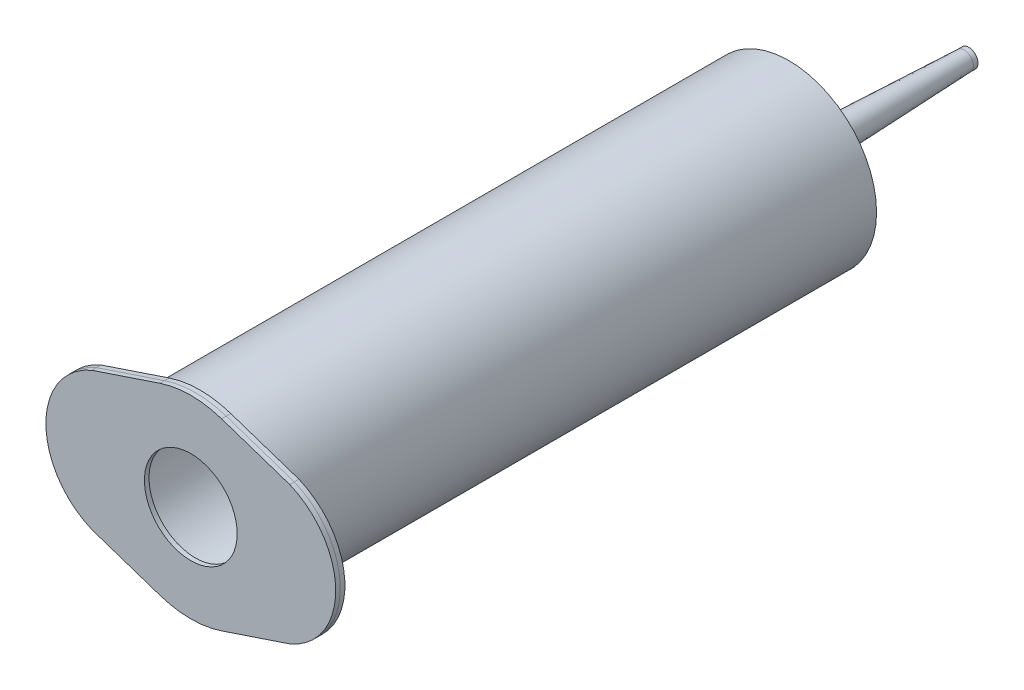
ISO-10303-21;
HEADER;
FILE_DESCRIPTION(('STEP AP214'),'2;1');
FILE_NAME('part.step','',(''),(''),'','','');
FILE_SCHEMA(('AUTOMOTIVE_DESIGN { 1 0 10303 214 1 1 1 1 }'));
ENDSEC;
DATA;
#1=APPLICATION_CONTEXT('core data for automotive mechanical design processes');
#2=APPLICATION_PROTOCOL_DEFINITION('international standard','automotive_design',2000,#1);
#3=PRODUCT_CONTEXT('',#1,'mechanical');
#4=PRODUCT('Part','Part','',(#3));
#5=PRODUCT_RELATED_PRODUCT_CATEGORY('part','',(#4));
#6=PRODUCT_DEFINITION_FORMATION('','',#4);
#7=PRODUCT_DEFINITION_CONTEXT('part definition',#1,'design');
#8=PRODUCT_DEFINITION('design','',#6,#7);
#9=PRODUCT_DEFINITION_SHAPE('','',#8);
#10=(LENGTH_UNIT() NAMED_UNIT(*) SI_UNIT(.MILLI.,.METRE.));
#11=(NAMED_UNIT(*) PLANE_ANGLE_UNIT() SI_UNIT($,.RADIAN.));
#12=(NAMED_UNIT(*) SI_UNIT($,.STERADIAN.) SOLID_ANGLE_UNIT());
#13=UNCERTAINTY_MEASURE_WITH_UNIT(LENGTH_MEASURE(1.E-05),#10,'distance_accuracy_value','');
#14=(GEOMETRIC_REPRESENTATION_CONTEXT(3) GLOBAL_UNCERTAINTY_ASSIGNED_CONTEXT((#13)) GLOBAL_UNIT_ASSIGNED_CONTEXT((#10,
#11,#12)) REPRESENTATION_CONTEXT('',''));
#15=CARTESIAN_POINT('',(0.,0.,0.));
#16=DIRECTION('',(0.,0.,1.));
#17=DIRECTION('',(1.,0.,0.));
#18=AXIS2_PLACEMENT_3D('',#15,#16,#17);
#19=CARTESIAN_POINT('',(6.68321649398183,19.9608896919593,126.));
#20=DIRECTION('',(0.31749247002289,0.94826079296719,0.));
#21=DIRECTION('',(-0.94826079296719,0.31749247002289,0.));
#22=AXIS2_PLACEMENT_3D('',#19,#20,#21);
#23=PLANE('',#22);
#24=DIRECTION('',(-0.94826079296719,0.31749247002289,0.));
#25=VECTOR('',#24,1.);
#26=CARTESIAN_POINT('',(6.68321649398183,19.9608896919593,127.));
#27=LINE('',#26,#25);
#28=CARTESIAN_POINT('',(21.4999999999999,15.,127.));
#29=VERTEX_POINT('',#28);
#30=CARTESIAN_POINT('',(6.68321649398172,19.9608896919593,127.));
#31=VERTEX_POINT('',#30);
#32=EDGE_CURVE('E174',#29,#31,#27,.T.);
#33=ORIENTED_EDGE('',*,*,#32,.F.);
#34=DIRECTION('',(0.,0.,1.));
#35=VECTOR('',#34,1.);
#36=CARTESIAN_POINT('',(21.4999999999999,15.,126.));
#37=LINE('',#36,#35);
#38=CARTESIAN_POINT('',(21.4999999999999,15.,126.));
#39=VERTEX_POINT('',#38);
#40=EDGE_CURVE('E13',#39,#29,#37,.T.);
#41=ORIENTED_EDGE('',*,*,#40,.F.);
#42=DIRECTION('',(-0.94826079296719,0.31749247002289,0.));
#43=VECTOR('',#42,1.);
#44=CARTESIAN_POINT('',(6.68321649398183,19.9608896919593,126.));
#45=LINE('',#44,#43);
#46=CARTESIAN_POINT('',(6.68321649398172,19.9608896919593,126.));
#47=VERTEX_POINT('',#46);
#48=EDGE_CURVE('E202',#39,#47,#45,.T.);
#49=ORIENTED_EDGE('',*,*,#48,.T.);
#50=DIRECTION('',(0.,0.,1.));
#51=VECTOR('',#50,1.);
#52=CARTESIAN_POINT('',(6.68321649398172,19.9608896919593,126.));
#53=LINE('',#52,#51);
#54=EDGE_CURVE('E75',#47,#31,#53,.T.);
#55=ORIENTED_EDGE('',*,*,#54,.T.);
#56=EDGE_LOOP('',(#33,#41,#49,#55));
#57=FACE_BOUND('',#56,.T.);
#58=ADVANCED_FACE('F71',(#57),#23,.T.);
#59=CARTESIAN_POINT('',(15.25,0.,126.));
#60=DIRECTION('',(0.,0.,1.));
#61=DIRECTION('',(1.,0.,0.));
#62=AXIS2_PLACEMENT_3D('',#59,#60,#61);
#63=CYLINDRICAL_SURFACE('',#62,16.2499999999999);
#64=CARTESIAN_POINT('',(15.25,0.,127.));
#65=DIRECTION('',(0.,0.,1.));
#66=DIRECTION('',(1.,0.,0.));
#67=AXIS2_PLACEMENT_3D('',#64,#65,#66);
#68=CIRCLE('',#67,16.2499999999999);
#69=CARTESIAN_POINT('',(21.5000000000001,-14.9999999999998,127.));
#70=VERTEX_POINT('',#69);
#71=EDGE_CURVE('E192',#29,#70,#68,.F.);
#72=ORIENTED_EDGE('',*,*,#71,.T.);
#73=DIRECTION('',(0.,0.,1.));
#74=VECTOR('',#73,1.);
#75=CARTESIAN_POINT('',(21.5000000000001,-14.9999999999998,126.));
#76=LINE('',#75,#74);
#77=CARTESIAN_POINT('',(21.5000000000001,-14.9999999999998,126.));
#78=VERTEX_POINT('',#77);
#79=EDGE_CURVE('E81',#78,#70,#76,.T.);
#80=ORIENTED_EDGE('',*,*,#79,.F.);
#81=CARTESIAN_POINT('',(15.25,0.,126.));
#82=DIRECTION('',(0.,0.,1.));
#83=DIRECTION('',(1.,0.,0.));
#84=AXIS2_PLACEMENT_3D('',#81,#82,#83);
#85=CIRCLE('',#84,16.2499999999999);
#86=EDGE_CURVE('E153',#39,#78,#85,.F.);
#87=ORIENTED_EDGE('',*,*,#86,.F.);
#88=ORIENTED_EDGE('',*,*,#40,.T.);
#89=EDGE_LOOP('',(#72,#80,#87,#88));
#90=FACE_BOUND('',#89,.T.);
#91=ADVANCED_FACE('F206',(#90),#63,.T.);
#92=CARTESIAN_POINT('',(6.68321649398213,-19.9608896919593,126.));
#93=DIRECTION('',(-0.317492470022903,0.948260792967186,0.));
#94=DIRECTION('',(-0.948260792967186,-0.317492470022903,0.));
#95=AXIS2_PLACEMENT_3D('',#92,#93,#94);
#96=PLANE('',#95);
#97=DIRECTION('',(-0.948260792967186,-0.317492470022903,0.));
#98=VECTOR('',#97,1.);
#99=CARTESIAN_POINT('',(6.68321649398213,-19.9608896919593,127.));
#100=LINE('',#99,#98);
#101=CARTESIAN_POINT('',(6.68321649398198,-19.9608896919593,127.));
#102=VERTEX_POINT('',#101);
#103=EDGE_CURVE('E118',#70,#102,#100,.T.);
#104=ORIENTED_EDGE('',*,*,#103,.T.);
#105=DIRECTION('',(0.,0.,1.));
#106=VECTOR('',#105,1.);
#107=CARTESIAN_POINT('',(6.68321649398198,-19.9608896919593,126.));
#108=LINE('',#107,#106);
#109=CARTESIAN_POINT('',(6.68321649398198,-19.9608896919593,126.));
#110=VERTEX_POINT('',#109);
#111=EDGE_CURVE('E157',#110,#102,#108,.T.);
#112=ORIENTED_EDGE('',*,*,#111,.F.);
#113=DIRECTION('',(-0.948260792967186,-0.317492470022903,0.));
#114=VECTOR('',#113,1.);
#115=CARTESIAN_POINT('',(6.68321649398213,-19.9608896919593,126.));
#116=LINE('',#115,#114);
#117=EDGE_CURVE('E145',#78,#110,#116,.T.);
#118=ORIENTED_EDGE('',*,*,#117,.F.);
#119=ORIENTED_EDGE('',*,*,#79,.T.);
#120=EDGE_LOOP('',(#104,#112,#118,#119));
#121=FACE_BOUND('',#120,.T.);
#122=ADVANCED_FACE('F158',(#121),#96,.F.);
#123=CARTESIAN_POINT('',(0.,0.,126.));
#124=DIRECTION('',(0.,0.,1.));
#125=DIRECTION('',(1.,0.,0.));
#126=AXIS2_PLACEMENT_3D('',#123,#124,#125);
#127=CYLINDRICAL_SURFACE('',#126,21.05);
#128=CARTESIAN_POINT('',(0.,0.,127.));
#129=DIRECTION('',(0.,0.,1.));
#130=DIRECTION('',(1.,0.,0.));
#131=AXIS2_PLACEMENT_3D('',#128,#129,#130);
#132=CIRCLE('',#131,21.05);
#133=CARTESIAN_POINT('',(-6.68321649398184,-19.9608896919593,127.));
#134=VERTEX_POINT('',#133);
#135=EDGE_CURVE('E189',#134,#102,#132,.T.);
#136=ORIENTED_EDGE('',*,*,#135,.F.);
#137=DIRECTION('',(0.,0.,1.));
#138=VECTOR('',#137,1.);
#139=CARTESIAN_POINT('',(-6.68321649398184,-19.9608896919593,126.));
#140=LINE('',#139,#138);
#141=CARTESIAN_POINT('',(-6.68321649398184,-19.9608896919593,126.));
#142=VERTEX_POINT('',#141);
#143=EDGE_CURVE('E161',#142,#134,#140,.T.);
#144=ORIENTED_EDGE('',*,*,#143,.F.);
#145=CARTESIAN_POINT('',(0.,0.,126.));
#146=DIRECTION('',(0.,0.,1.));
#147=DIRECTION('',(1.,0.,0.));
#148=AXIS2_PLACEMENT_3D('',#145,#146,#147);
#149=CIRCLE('',#148,21.05);
#150=EDGE_CURVE('E151',#142,#110,#149,.T.);
#151=ORIENTED_EDGE('',*,*,#150,.T.);
#152=ORIENTED_EDGE('',*,*,#111,.T.);
#153=EDGE_LOOP('',(#136,#144,#151,#152));
#154=FACE_BOUND('',#153,.T.);
#155=ADVANCED_FACE('F163',(#154),#127,.T.);
#156=CARTESIAN_POINT('',(-6.68321649398183,-19.9608896919593,126.));
#157=DIRECTION('',(-0.31749247002289,-0.94826079296719,0.));
#158=DIRECTION('',(0.94826079296719,-0.31749247002289,0.));
#159=AXIS2_PLACEMENT_3D('',#156,#157,#158);
#160=PLANE('',#159);
#161=DIRECTION('',(0.94826079296719,-0.31749247002289,0.));
#162=VECTOR('',#161,1.);
#163=CARTESIAN_POINT('',(-6.68321649398183,-19.9608896919593,127.));
#164=LINE('',#163,#162);
#165=CARTESIAN_POINT('',(-21.5,-15.,127.));
#166=VERTEX_POINT('',#165);
#167=EDGE_CURVE('E186',#166,#134,#164,.T.);
#168=ORIENTED_EDGE('',*,*,#167,.F.);
#169=DIRECTION('',(0.,0.,1.));
#170=VECTOR('',#169,1.);
#171=CARTESIAN_POINT('',(-21.5,-15.,126.));
#172=LINE('',#171,#170);
#173=CARTESIAN_POINT('',(-21.5,-15.,126.));
#174=VERTEX_POINT('',#173);
#175=EDGE_CURVE('E197',#174,#166,#172,.T.);
#176=ORIENTED_EDGE('',*,*,#175,.F.);
#177=DIRECTION('',(0.94826079296719,-0.31749247002289,0.));
#178=VECTOR('',#177,1.);
#179=CARTESIAN_POINT('',(-6.68321649398183,-19.9608896919593,126.));
#180=LINE('',#179,#178);
#181=EDGE_CURVE('E164',#174,#142,#180,.T.);
#182=ORIENTED_EDGE('',*,*,#181,.T.);
#183=ORIENTED_EDGE('',*,*,#143,.T.);
#184=EDGE_LOOP('',(#168,#176,#182,#183));
#185=FACE_BOUND('',#184,.T.);
#186=ADVANCED_FACE('F222',(#185),#160,.T.);
#187=CARTESIAN_POINT('',(-15.25,0.,126.));
#188=DIRECTION('',(0.,0.,1.));
#189=DIRECTION('',(1.,0.,0.));
#190=AXIS2_PLACEMENT_3D('',#187,#188,#189);
#191=CYLINDRICAL_SURFACE('',#190,16.25);
#192=CARTESIAN_POINT('',(-15.25,0.,127.));
#193=DIRECTION('',(0.,0.,1.));
#194=DIRECTION('',(1.,0.,0.));
#195=AXIS2_PLACEMENT_3D('',#192,#193,#194);
#196=CIRCLE('',#195,16.25);
#197=CARTESIAN_POINT('',(-21.5,15.,127.));
#198=VERTEX_POINT('',#197);
#199=EDGE_CURVE('E183',#198,#166,#196,.T.);
#200=ORIENTED_EDGE('',*,*,#199,.F.);
#201=DIRECTION('',(0.,0.,1.));
#202=VECTOR('',#201,1.);
#203=CARTESIAN_POINT('',(-21.5,15.,126.));
#204=LINE('',#203,#202);
#205=CARTESIAN_POINT('',(-21.5,15.,126.));
#206=VERTEX_POINT('',#205);
#207=EDGE_CURVE('E199',#206,#198,#204,.T.);
#208=ORIENTED_EDGE('',*,*,#207,.F.);
#209=CARTESIAN_POINT('',(-15.25,0.,126.));
#210=DIRECTION('',(0.,0.,1.));
#211=DIRECTION('',(1.,0.,0.));
#212=AXIS2_PLACEMENT_3D('',#209,#210,#211);
#213=CIRCLE('',#212,16.25);
#214=EDGE_CURVE('E166',#206,#174,#213,.T.);
#215=ORIENTED_EDGE('',*,*,#214,.T.);
#216=ORIENTED_EDGE('',*,*,#175,.T.);
#217=EDGE_LOOP('',(#200,#208,#215,#216));
#218=FACE_BOUND('',#217,.T.);
#219=ADVANCED_FACE('F218',(#218),#191,.T.);
#220=CARTESIAN_POINT('',(-6.68321649398185,19.9608896919593,126.));
#221=DIRECTION('',(0.317492470022891,-0.94826079296719,0.));
#222=DIRECTION('',(0.94826079296719,0.317492470022891,0.));
#223=AXIS2_PLACEMENT_3D('',#220,#221,#222);
#224=PLANE('',#223);
#225=DIRECTION('',(0.94826079296719,0.317492470022891,0.));
#226=VECTOR('',#225,1.);
#227=CARTESIAN_POINT('',(-6.68321649398185,19.9608896919593,127.));
#228=LINE('',#227,#226);
#229=CARTESIAN_POINT('',(-6.68321649398185,19.9608896919593,127.));
#230=VERTEX_POINT('',#229);
#231=EDGE_CURVE('E180',#198,#230,#228,.T.);
#232=ORIENTED_EDGE('',*,*,#231,.T.);
#233=DIRECTION('',(0.,0.,1.));
#234=VECTOR('',#233,1.);
#235=CARTESIAN_POINT('',(-6.68321649398185,19.9608896919593,126.));
#236=LINE('',#235,#234);
#237=CARTESIAN_POINT('',(-6.68321649398185,19.9608896919593,126.));
#238=VERTEX_POINT('',#237);
#239=EDGE_CURVE('E200',#238,#230,#236,.T.);
#240=ORIENTED_EDGE('',*,*,#239,.F.);
#241=DIRECTION('',(0.94826079296719,0.317492470022891,0.));
#242=VECTOR('',#241,1.);
#243=CARTESIAN_POINT('',(-6.68321649398185,19.9608896919593,126.));
#244=LINE('',#243,#242);
#245=EDGE_CURVE('E209',#206,#238,#244,.T.);
#246=ORIENTED_EDGE('',*,*,#245,.F.);
#247=ORIENTED_EDGE('',*,*,#207,.T.);
#248=EDGE_LOOP('',(#232,#240,#246,#247));
#249=FACE_BOUND('',#248,.T.);
#250=ADVANCED_FACE('F224',(#249),#224,.F.);
#251=CARTESIAN_POINT('',(0.,0.,126.));
#252=DIRECTION('',(0.,0.,1.));
#253=DIRECTION('',(1.,0.,0.));
#254=AXIS2_PLACEMENT_3D('',#251,#252,#253);
#255=CYLINDRICAL_SURFACE('',#254,19.05);
#256=CARTESIAN_POINT('',(0.,0.,126.));
#257=DIRECTION('',(0.,0.,1.));
#258=DIRECTION('',(1.,0.,0.));
#259=AXIS2_PLACEMENT_3D('',#256,#257,#258);
#260=CIRCLE('',#259,19.05);
#261=CARTESIAN_POINT('',(19.05,0.,126.));
#262=VERTEX_POINT('',#261);
#263=EDGE_CURVE('E193',#262,#262,#260,.T.);
#264=ORIENTED_EDGE('',*,*,#263,.F.);
#265=EDGE_LOOP('',(#264));
#266=FACE_BOUND('',#265,.T.);
#267=CARTESIAN_POINT('',(0.,0.,127.));
#268=DIRECTION('',(0.,0.,1.));
#269=DIRECTION('',(1.,0.,0.));
#270=AXIS2_PLACEMENT_3D('',#267,#268,#269);
#271=CIRCLE('',#270,19.05);
#272=CARTESIAN_POINT('',(19.05,0.,127.));
#273=VERTEX_POINT('',#272);
#274=EDGE_CURVE('E171',#273,#273,#271,.T.);
#275=ORIENTED_EDGE('',*,*,#274,.T.);
#276=EDGE_LOOP('',(#275));
#277=FACE_BOUND('',#276,.T.);
#278=ADVANCED_FACE('F73',(#266,#277),#255,.F.);
#279=CARTESIAN_POINT('',(0.,0.,126.));
#280=DIRECTION('',(0.,0.,1.));
#281=DIRECTION('',(1.,0.,0.));
#282=AXIS2_PLACEMENT_3D('',#279,#280,#281);
#283=CYLINDRICAL_SURFACE('',#282,21.05);
#284=CARTESIAN_POINT('',(0.,0.,127.));
#285=DIRECTION('',(0.,0.,1.));
#286=DIRECTION('',(1.,0.,0.));
#287=AXIS2_PLACEMENT_3D('',#284,#285,#286);
#288=CIRCLE('',#287,21.05);
#289=EDGE_CURVE('E177',#31,#230,#288,.T.);
#290=ORIENTED_EDGE('',*,*,#289,.F.);
#291=ORIENTED_EDGE('',*,*,#54,.F.);
#292=CARTESIAN_POINT('',(0.,0.,126.));
#293=DIRECTION('',(0.,0.,1.));
#294=DIRECTION('',(1.,0.,0.));
#295=AXIS2_PLACEMENT_3D('',#292,#293,#294);
#296=CIRCLE('',#295,21.05);
#297=EDGE_CURVE('E207',#47,#238,#296,.T.);
#298=ORIENTED_EDGE('',*,*,#297,.T.);
#299=ORIENTED_EDGE('',*,*,#239,.T.);
#300=EDGE_LOOP('',(#290,#291,#298,#299));
#301=FACE_BOUND('',#300,.T.);
#302=ADVANCED_FACE('F203',(#301),#283,.T.);
#303=CARTESIAN_POINT('',(0.,0.,126.));
#304=DIRECTION('',(0.,0.,1.));
#305=DIRECTION('',(1.,0.,0.));
#306=AXIS2_PLACEMENT_3D('',#303,#304,#305);
#307=PLANE('',#306);
#308=ORIENTED_EDGE('',*,*,#263,.T.);
#309=EDGE_LOOP('',(#308));
#310=FACE_BOUND('',#309,.T.);
#311=ORIENTED_EDGE('',*,*,#48,.F.);
#312=ORIENTED_EDGE('',*,*,#86,.T.);
#313=ORIENTED_EDGE('',*,*,#117,.T.);
#314=ORIENTED_EDGE('',*,*,#150,.F.);
#315=ORIENTED_EDGE('',*,*,#181,.F.);
#316=ORIENTED_EDGE('',*,*,#214,.F.);
#317=ORIENTED_EDGE('',*,*,#245,.T.);
#318=ORIENTED_EDGE('',*,*,#297,.F.);
#319=EDGE_LOOP('',(#311,#312,#313,#314,#315,#316,#317,#318));
#320=FACE_BOUND('',#319,.T.);
#321=ADVANCED_FACE('F148',(#310,#320),#307,.F.);
#322=CARTESIAN_POINT('',(0.,0.,127.));
#323=DIRECTION('',(0.,0.,1.));
#324=DIRECTION('',(1.,0.,0.));
#325=AXIS2_PLACEMENT_3D('',#322,#323,#324);
#326=PLANE('',#325);
#327=ORIENTED_EDGE('',*,*,#274,.F.);
#328=EDGE_LOOP('',(#327));
#329=FACE_BOUND('',#328,.T.);
#330=ORIENTED_EDGE('',*,*,#32,.T.);
#331=ORIENTED_EDGE('',*,*,#289,.T.);
#332=ORIENTED_EDGE('',*,*,#231,.F.);
#333=ORIENTED_EDGE('',*,*,#199,.T.);
#334=ORIENTED_EDGE('',*,*,#167,.T.);
#335=ORIENTED_EDGE('',*,*,#135,.T.);
#336=ORIENTED_EDGE('',*,*,#103,.F.);
#337=ORIENTED_EDGE('',*,*,#71,.F.);
#338=EDGE_LOOP('',(#330,#331,#332,#333,#334,#335,#336,#337));
#339=FACE_BOUND('',#338,.T.);
#340=ADVANCED_FACE('F205',(#329,#339),#326,.T.);
#341=CLOSED_SHELL('',(#58,#91,#122,#155,#186,#219,#250,#278,#302,#321,#340));
#342=MANIFOLD_SOLID_BREP('B2',#341);
#343=CARTESIAN_POINT('',(0.,0.,127.));
#344=DIRECTION('',(0.,0.,-1.));
#345=DIRECTION('',(-1.,0.,0.));
#346=AXIS2_PLACEMENT_3D('',#343,#344,#345);
#347=CYLINDRICAL_SURFACE('',#346,19.05);
#348=CARTESIAN_POINT('',(0.,0.,127.));
#349=DIRECTION('',(0.,0.,1.));
#350=DIRECTION('',(1.,0.,0.));
#351=AXIS2_PLACEMENT_3D('',#348,#349,#350);
#352=CIRCLE('',#351,19.05);
#353=CARTESIAN_POINT('',(19.05,0.,127.));
#354=VERTEX_POINT('',#353);
#355=EDGE_CURVE('E328',#354,#354,#352,.T.);
#356=ORIENTED_EDGE('',*,*,#355,.F.);
#357=EDGE_LOOP('',(#356));
#358=FACE_BOUND('',#357,.T.);
#359=CARTESIAN_POINT('',(0.,0.,-2.));
#360=DIRECTION('',(0.,0.,1.));
#361=DIRECTION('',(1.,0.,0.));
#362=AXIS2_PLACEMENT_3D('',#359,#360,#361);
#363=CIRCLE('',#362,19.05);
#364=CARTESIAN_POINT('',(19.05,0.,-2.));
#365=VERTEX_POINT('',#364);
#366=EDGE_CURVE('E478',#365,#365,#363,.T.);
#367=ORIENTED_EDGE('',*,*,#366,.T.);
#368=EDGE_LOOP('',(#367));
#369=FACE_BOUND('',#368,.T.);
#370=ADVANCED_FACE('F320',(#358,#369),#347,.T.);
#371=CARTESIAN_POINT('',(0.,0.,127.));
#372=DIRECTION('',(0.,0.,-1.));
#373=DIRECTION('',(-1.,0.,0.));
#374=AXIS2_PLACEMENT_3D('',#371,#372,#373);
#375=CYLINDRICAL_SURFACE('',#374,15.08125);
#376=CARTESIAN_POINT('',(0.,0.,127.));
#377=DIRECTION('',(0.,0.,1.));
#378=DIRECTION('',(1.,0.,0.));
#379=AXIS2_PLACEMENT_3D('',#376,#377,#378);
#380=CIRCLE('',#379,15.08125);
#381=CARTESIAN_POINT('',(15.08125,0.,127.));
#382=VERTEX_POINT('',#381);
#383=EDGE_CURVE('E456',#382,#382,#380,.T.);
#384=ORIENTED_EDGE('',*,*,#383,.T.);
#385=EDGE_LOOP('',(#384));
#386=FACE_BOUND('',#385,.T.);
#387=CARTESIAN_POINT('',(0.,0.,0.));
#388=DIRECTION('',(0.,0.,1.));
#389=DIRECTION('',(1.,0.,0.));
#390=AXIS2_PLACEMENT_3D('',#387,#388,#389);
#391=CIRCLE('',#390,15.08125);
#392=CARTESIAN_POINT('',(15.08125,0.,0.));
#393=VERTEX_POINT('',#392);
#394=EDGE_CURVE('E481',#393,#393,#391,.T.);
#395=ORIENTED_EDGE('',*,*,#394,.F.);
#396=EDGE_LOOP('',(#395));
#397=FACE_BOUND('',#396,.T.);
#398=ADVANCED_FACE('F493',(#386,#397),#375,.F.);
#399=CARTESIAN_POINT('',(0.,0.,0.));
#400=DIRECTION('',(0.,0.,1.));
#401=DIRECTION('',(1.,0.,0.));
#402=AXIS2_PLACEMENT_3D('',#399,#400,#401);
#403=PLANE('',#402);
#404=CARTESIAN_POINT('',(0.,0.,0.));
#405=DIRECTION('',(0.,0.,1.));
#406=DIRECTION('',(1.,0.,0.));
#407=AXIS2_PLACEMENT_3D('',#404,#405,#406);
#408=CIRCLE('',#407,2.5);
#409=CARTESIAN_POINT('',(2.5,0.,0.));
#410=VERTEX_POINT('',#409);
#411=EDGE_CURVE('E475',#410,#410,#408,.T.);
#412=ORIENTED_EDGE('',*,*,#411,.F.);
#413=EDGE_LOOP('',(#412));
#414=FACE_BOUND('',#413,.T.);
#415=ORIENTED_EDGE('',*,*,#394,.T.);
#416=EDGE_LOOP('',(#415));
#417=FACE_BOUND('',#416,.T.);
#418=ADVANCED_FACE('F499',(#414,#417),#403,.T.);
#419=CARTESIAN_POINT('',(0.,0.,-2.));
#420=DIRECTION('',(0.,0.,1.));
#421=DIRECTION('',(1.,0.,0.));
#422=AXIS2_PLACEMENT_3D('',#419,#420,#421);
#423=PLANE('',#422);
#424=CARTESIAN_POINT('',(0.,0.,-2.));
#425=DIRECTION('',(0.,0.,1.));
#426=DIRECTION('',(1.,0.,0.));
#427=AXIS2_PLACEMENT_3D('',#424,#425,#426);
#428=CIRCLE('',#427,3.5);
#429=CARTESIAN_POINT('',(3.5,0.,-2.));
#430=VERTEX_POINT('',#429);
#431=EDGE_CURVE('E69',#430,#430,#428,.F.);
#432=ORIENTED_EDGE('',*,*,#431,.F.);
#433=EDGE_LOOP('',(#432));
#434=FACE_BOUND('',#433,.T.);
#435=ORIENTED_EDGE('',*,*,#366,.F.);
#436=EDGE_LOOP('',(#435));
#437=FACE_BOUND('',#436,.T.);
#438=ADVANCED_FACE('F496',(#434,#437),#423,.F.);
#439=CARTESIAN_POINT('',(0.,0.,127.));
#440=DIRECTION('',(0.,0.,-1.));
#441=DIRECTION('',(-1.,0.,0.));
#442=AXIS2_PLACEMENT_3D('',#439,#440,#441);
#443=CYLINDRICAL_SURFACE('',#442,2.5);
#444=ORIENTED_EDGE('',*,*,#411,.T.);
#445=EDGE_LOOP('',(#444));
#446=FACE_BOUND('',#445,.T.);
#447=CARTESIAN_POINT('',(0.,0.,-3.));
#448=DIRECTION('',(0.,0.,1.));
#449=DIRECTION('',(1.,0.,0.));
#450=AXIS2_PLACEMENT_3D('',#447,#448,#449);
#451=CIRCLE('',#450,2.5);
#452=CARTESIAN_POINT('',(2.5,0.,-3.));
#453=VERTEX_POINT('',#452);
#454=EDGE_CURVE('E469',#453,#453,#451,.T.);
#455=ORIENTED_EDGE('',*,*,#454,.F.);
#456=EDGE_LOOP('',(#455));
#457=FACE_BOUND('',#456,.T.);
#458=ADVANCED_FACE('F498',(#446,#457),#443,.F.);
#459=CARTESIAN_POINT('',(0.,0.,-3.));
#460=DIRECTION('',(0.,0.,1.));
#461=DIRECTION('',(1.,0.,0.));
#462=AXIS2_PLACEMENT_3D('',#459,#460,#461);
#463=CYLINDRICAL_SURFACE('',#462,3.5);
#464=CARTESIAN_POINT('',(0.,0.,-3.));
#465=DIRECTION('',(0.,0.,-1.));
#466=DIRECTION('',(-1.,0.,0.));
#467=AXIS2_PLACEMENT_3D('',#464,#465,#466);
#468=CIRCLE('',#467,3.5);
#469=CARTESIAN_POINT('',(-3.5,0.,-3.));
#470=VERTEX_POINT('',#469);
#471=EDGE_CURVE('E472',#470,#470,#468,.T.);
#472=ORIENTED_EDGE('',*,*,#471,.F.);
#473=EDGE_LOOP('',(#472));
#474=FACE_BOUND('',#473,.T.);
#475=ORIENTED_EDGE('',*,*,#431,.T.);
#476=EDGE_LOOP('',(#475));
#477=FACE_BOUND('',#476,.T.);
#478=ADVANCED_FACE('F506',(#474,#477),#463,.T.);
#479=CARTESIAN_POINT('',(0.,0.,-3.));
#480=DIRECTION('',(0.,0.,1.));
#481=DIRECTION('',(1.,0.,0.));
#482=AXIS2_PLACEMENT_3D('',#479,#480,#481);
#483=CONICAL_SURFACE('',#482,2.5,0.0404092576026024);
#484=CARTESIAN_POINT('',(0.,0.,-40.1));
#485=DIRECTION('',(0.,0.,1.));
#486=DIRECTION('',(1.,0.,0.));
#487=AXIS2_PLACEMENT_3D('',#484,#485,#486);
#488=CIRCLE('',#487,1.);
#489=CARTESIAN_POINT('',(1.,0.,-40.1));
#490=VERTEX_POINT('',#489);
#491=EDGE_CURVE('E464',#490,#490,#488,.T.);
#492=ORIENTED_EDGE('',*,*,#491,.F.);
#493=EDGE_LOOP('',(#492));
#494=FACE_BOUND('',#493,.T.);
#495=ORIENTED_EDGE('',*,*,#454,.T.);
#496=EDGE_LOOP('',(#495));
#497=FACE_BOUND('',#496,.T.);
#498=ADVANCED_FACE('F583',(#494,#497),#483,.F.);
#499=CARTESIAN_POINT('',(0.,0.,-40.1));
#500=DIRECTION('',(0.,0.,1.));
#501=DIRECTION('',(1.,0.,0.));
#502=AXIS2_PLACEMENT_3D('',#499,#500,#501);
#503=CONICAL_SURFACE('',#502,2.,0.0404092576026024);
#504=ORIENTED_EDGE('',*,*,#471,.T.);
#505=EDGE_LOOP('',(#504));
#506=FACE_BOUND('',#505,.T.);
#507=CARTESIAN_POINT('',(0.,0.,-40.1));
#508=DIRECTION('',(0.,0.,-1.));
#509=DIRECTION('',(-1.,0.,0.));
#510=AXIS2_PLACEMENT_3D('',#507,#508,#509);
#511=CIRCLE('',#510,2.);
#512=CARTESIAN_POINT('',(-2.,0.,-40.1));
#513=VERTEX_POINT('',#512);
#514=EDGE_CURVE('E461',#513,#513,#511,.T.);
#515=ORIENTED_EDGE('',*,*,#514,.F.);
#516=EDGE_LOOP('',(#515));
#517=FACE_BOUND('',#516,.T.);
#518=ADVANCED_FACE('F579',(#506,#517),#503,.T.);
#519=CARTESIAN_POINT('',(0.,0.,-41.1));
#520=DIRECTION('',(0.,0.,1.));
#521=DIRECTION('',(1.,0.,0.));
#522=AXIS2_PLACEMENT_3D('',#519,#520,#521);
#523=CYLINDRICAL_SURFACE('',#522,1.);
#524=CARTESIAN_POINT('',(0.,0.,-41.1));
#525=DIRECTION('',(0.,0.,-1.));
#526=DIRECTION('',(-1.,0.,0.));
#527=AXIS2_PLACEMENT_3D('',#524,#525,#526);
#528=CIRCLE('',#527,1.);
#529=CARTESIAN_POINT('',(-1.,0.,-41.1));
#530=VERTEX_POINT('',#529);
#531=EDGE_CURVE('E457',#530,#530,#528,.T.);
#532=ORIENTED_EDGE('',*,*,#531,.T.);
#533=EDGE_LOOP('',(#532));
#534=FACE_BOUND('',#533,.T.);
#535=ORIENTED_EDGE('',*,*,#491,.T.);
#536=EDGE_LOOP('',(#535));
#537=FACE_BOUND('',#536,.T.);
#538=ADVANCED_FACE('F575',(#534,#537),#523,.F.);
#539=CARTESIAN_POINT('',(0.,0.,-41.1));
#540=DIRECTION('',(0.,0.,1.));
#541=DIRECTION('',(1.,0.,0.));
#542=AXIS2_PLACEMENT_3D('',#539,#540,#541);
#543=CYLINDRICAL_SURFACE('',#542,2.);
#544=CARTESIAN_POINT('',(0.,0.,-41.1));
#545=DIRECTION('',(0.,0.,-1.));
#546=DIRECTION('',(-1.,0.,0.));
#547=AXIS2_PLACEMENT_3D('',#544,#545,#546);
#548=CIRCLE('',#547,2.);
#549=CARTESIAN_POINT('',(-2.,0.,-41.1));
#550=VERTEX_POINT('',#549);
#551=EDGE_CURVE('E460',#550,#550,#548,.T.);
#552=ORIENTED_EDGE('',*,*,#551,.F.);
#553=EDGE_LOOP('',(#552));
#554=FACE_BOUND('',#553,.T.);
#555=ORIENTED_EDGE('',*,*,#514,.T.);
#556=EDGE_LOOP('',(#555));
#557=FACE_BOUND('',#556,.T.);
#558=ADVANCED_FACE('F534',(#554,#557),#543,.T.);
#559=CARTESIAN_POINT('',(0.,0.,-41.1));
#560=DIRECTION('',(0.,0.,-1.));
#561=DIRECTION('',(-1.,0.,0.));
#562=AXIS2_PLACEMENT_3D('',#559,#560,#561);
#563=PLANE('',#562);
#564=ORIENTED_EDGE('',*,*,#531,.F.);
#565=EDGE_LOOP('',(#564));
#566=FACE_BOUND('',#565,.T.);
#567=ORIENTED_EDGE('',*,*,#551,.T.);
#568=EDGE_LOOP('',(#567));
#569=FACE_BOUND('',#568,.T.);
#570=ADVANCED_FACE('F525',(#566,#569),#563,.T.);
#571=CARTESIAN_POINT('',(0.,0.,127.));
#572=DIRECTION('',(0.,0.,1.));
#573=DIRECTION('',(1.,0.,0.));
#574=AXIS2_PLACEMENT_3D('',#571,#572,#573);
#575=PLANE('',#574);
#576=CARTESIAN_POINT('',(0.,0.,127.));
#577=DIRECTION('',(0.,0.,1.));
#578=DIRECTION('',(1.,0.,0.));
#579=AXIS2_PLACEMENT_3D('',#576,#577,#578);
#580=CIRCLE('',#579,10.08125);
#581=CARTESIAN_POINT('',(10.08125,0.,127.));
#582=VERTEX_POINT('',#581);
#583=EDGE_CURVE('E440',#582,#582,#580,.T.);
#584=ORIENTED_EDGE('',*,*,#583,.T.);
#585=EDGE_LOOP('',(#584));
#586=FACE_BOUND('',#585,.T.);
#587=ORIENTED_EDGE('',*,*,#383,.F.);
#588=EDGE_LOOP('',(#587));
#589=FACE_BOUND('',#588,.T.);
#590=ADVANCED_FACE('F522',(#586,#589),#575,.F.);
#591=CARTESIAN_POINT('',(6.68321649398183,19.9608896919593,128.));
#592=DIRECTION('',(-0.31749247002289,-0.94826079296719,0.));
#593=DIRECTION('',(0.94826079296719,-0.31749247002289,0.));
#594=AXIS2_PLACEMENT_3D('',#591,#592,#593);
#595=PLANE('',#594);
#596=DIRECTION('',(-0.94826079296719,0.31749247002289,0.));
#597=VECTOR('',#596,1.);
#598=CARTESIAN_POINT('',(6.68321649398183,19.9608896919593,127.));
#599=LINE('',#598,#597);
#600=CARTESIAN_POINT('',(21.4999999999999,15.,127.));
#601=VERTEX_POINT('',#600);
#602=CARTESIAN_POINT('',(6.68321649398172,19.9608896919593,127.));
#603=VERTEX_POINT('',#602);
#604=EDGE_CURVE('E422',#601,#603,#599,.T.);
#605=ORIENTED_EDGE('',*,*,#604,.T.);
#606=DIRECTION('',(0.,0.,-1.));
#607=VECTOR('',#606,1.);
#608=CARTESIAN_POINT('',(6.68321649398172,19.9608896919593,128.));
#609=LINE('',#608,#607);
#610=CARTESIAN_POINT('',(6.68321649398172,19.9608896919593,128.));
#611=VERTEX_POINT('',#610);
#612=EDGE_CURVE('E454',#611,#603,#609,.T.);
#613=ORIENTED_EDGE('',*,*,#612,.F.);
#614=DIRECTION('',(-0.94826079296719,0.31749247002289,0.));
#615=VECTOR('',#614,1.);
#616=CARTESIAN_POINT('',(6.68321649398183,19.9608896919593,128.));
#617=LINE('',#616,#615);
#618=CARTESIAN_POINT('',(21.4999999999999,15.,128.));
#619=VERTEX_POINT('',#618);
#620=EDGE_CURVE('E443',#619,#611,#617,.T.);
#621=ORIENTED_EDGE('',*,*,#620,.F.);
#622=DIRECTION('',(0.,0.,-1.));
#623=VECTOR('',#622,1.);
#624=CARTESIAN_POINT('',(21.4999999999999,15.,128.));
#625=LINE('',#624,#623);
#626=EDGE_CURVE('E336',#619,#601,#625,.T.);
#627=ORIENTED_EDGE('',*,*,#626,.T.);
#628=EDGE_LOOP('',(#605,#613,#621,#627));
#629=FACE_BOUND('',#628,.T.);
#630=ADVANCED_FACE('F524',(#629),#595,.F.);
#631=CARTESIAN_POINT('',(0.,0.,128.));
#632=DIRECTION('',(0.,0.,-1.));
#633=DIRECTION('',(-1.,0.,0.));
#634=AXIS2_PLACEMENT_3D('',#631,#632,#633);
#635=CYLINDRICAL_SURFACE('',#634,21.05);
#636=CARTESIAN_POINT('',(0.,0.,127.));
#637=DIRECTION('',(0.,0.,1.));
#638=DIRECTION('',(1.,0.,0.));
#639=AXIS2_PLACEMENT_3D('',#636,#637,#638);
#640=CIRCLE('',#639,21.05);
#641=CARTESIAN_POINT('',(-6.68321649398185,19.9608896919593,127.));
#642=VERTEX_POINT('',#641);
#643=EDGE_CURVE('E424',#603,#642,#640,.T.);
#644=ORIENTED_EDGE('',*,*,#643,.T.);
#645=DIRECTION('',(0.,0.,-1.));
#646=VECTOR('',#645,1.);
#647=CARTESIAN_POINT('',(-6.68321649398185,19.9608896919593,128.));
#648=LINE('',#647,#646);
#649=CARTESIAN_POINT('',(-6.68321649398185,19.9608896919593,128.));
#650=VERTEX_POINT('',#649);
#651=EDGE_CURVE('E452',#650,#642,#648,.T.);
#652=ORIENTED_EDGE('',*,*,#651,.F.);
#653=CARTESIAN_POINT('',(0.,0.,128.));
#654=DIRECTION('',(0.,0.,1.));
#655=DIRECTION('',(1.,0.,0.));
#656=AXIS2_PLACEMENT_3D('',#653,#654,#655);
#657=CIRCLE('',#656,21.05);
#658=EDGE_CURVE('E375',#611,#650,#657,.T.);
#659=ORIENTED_EDGE('',*,*,#658,.F.);
#660=ORIENTED_EDGE('',*,*,#612,.T.);
#661=EDGE_LOOP('',(#644,#652,#659,#660));
#662=FACE_BOUND('',#661,.T.);
#663=ADVANCED_FACE('F532',(#662),#635,.T.);
#664=CARTESIAN_POINT('',(-6.68321649398185,19.9608896919593,128.));
#665=DIRECTION('',(-0.317492470022891,0.94826079296719,0.));
#666=DIRECTION('',(-0.94826079296719,-0.317492470022891,0.));
#667=AXIS2_PLACEMENT_3D('',#664,#665,#666);
#668=PLANE('',#667);
#669=DIRECTION('',(0.94826079296719,0.317492470022891,0.));
#670=VECTOR('',#669,1.);
#671=CARTESIAN_POINT('',(-6.68321649398185,19.9608896919593,127.));
#672=LINE('',#671,#670);
#673=CARTESIAN_POINT('',(-21.5,15.,127.));
#674=VERTEX_POINT('',#673);
#675=EDGE_CURVE('E427',#674,#642,#672,.T.);
#676=ORIENTED_EDGE('',*,*,#675,.F.);
#677=DIRECTION('',(0.,0.,-1.));
#678=VECTOR('',#677,1.);
#679=CARTESIAN_POINT('',(-21.5,15.,128.));
#680=LINE('',#679,#678);
#681=CARTESIAN_POINT('',(-21.5,15.,128.));
#682=VERTEX_POINT('',#681);
#683=EDGE_CURVE('E450',#682,#674,#680,.T.);
#684=ORIENTED_EDGE('',*,*,#683,.F.);
#685=DIRECTION('',(0.94826079296719,0.317492470022891,0.));
#686=VECTOR('',#685,1.);
#687=CARTESIAN_POINT('',(-6.68321649398185,19.9608896919593,128.));
#688=LINE('',#687,#686);
#689=EDGE_CURVE('E753',#682,#650,#688,.T.);
#690=ORIENTED_EDGE('',*,*,#689,.T.);
#691=ORIENTED_EDGE('',*,*,#651,.T.);
#692=EDGE_LOOP('',(#676,#684,#690,#691));
#693=FACE_BOUND('',#692,.T.);
#694=ADVANCED_FACE('F566',(#693),#668,.T.);
#695=CARTESIAN_POINT('',(-15.25,0.,128.));
#696=DIRECTION('',(0.,0.,-1.));
#697=DIRECTION('',(-1.,0.,0.));
#698=AXIS2_PLACEMENT_3D('',#695,#696,#697);
#699=CYLINDRICAL_SURFACE('',#698,16.25);
#700=CARTESIAN_POINT('',(-15.25,0.,127.));
#701=DIRECTION('',(0.,0.,1.));
#702=DIRECTION('',(1.,0.,0.));
#703=AXIS2_PLACEMENT_3D('',#700,#701,#702);
#704=CIRCLE('',#703,16.25);
#705=CARTESIAN_POINT('',(-21.5,-15.,127.));
#706=VERTEX_POINT('',#705);
#707=EDGE_CURVE('E430',#674,#706,#704,.T.);
#708=ORIENTED_EDGE('',*,*,#707,.T.);
#709=DIRECTION('',(0.,0.,-1.));
#710=VECTOR('',#709,1.);
#711=CARTESIAN_POINT('',(-21.5,-15.,128.));
#712=LINE('',#711,#710);
#713=CARTESIAN_POINT('',(-21.5,-15.,128.));
#714=VERTEX_POINT('',#713);
#715=EDGE_CURVE('E447',#714,#706,#712,.T.);
#716=ORIENTED_EDGE('',*,*,#715,.F.);
#717=CARTESIAN_POINT('',(-15.25,0.,128.));
#718=DIRECTION('',(0.,0.,1.));
#719=DIRECTION('',(1.,0.,0.));
#720=AXIS2_PLACEMENT_3D('',#717,#718,#719);
#721=CIRCLE('',#720,16.25);
#722=EDGE_CURVE('E754',#682,#714,#721,.T.);
#723=ORIENTED_EDGE('',*,*,#722,.F.);
#724=ORIENTED_EDGE('',*,*,#683,.T.);
#725=EDGE_LOOP('',(#708,#716,#723,#724));
#726=FACE_BOUND('',#725,.T.);
#727=ADVANCED_FACE('F562',(#726),#699,.T.);
#728=CARTESIAN_POINT('',(-6.68321649398183,-19.9608896919593,128.));
#729=DIRECTION('',(0.31749247002289,0.94826079296719,0.));
#730=DIRECTION('',(-0.94826079296719,0.31749247002289,0.));
#731=AXIS2_PLACEMENT_3D('',#728,#729,#730);
#732=PLANE('',#731);
#733=DIRECTION('',(0.94826079296719,-0.31749247002289,0.));
#734=VECTOR('',#733,1.);
#735=CARTESIAN_POINT('',(-6.68321649398183,-19.9608896919593,127.));
#736=LINE('',#735,#734);
#737=CARTESIAN_POINT('',(-6.68321649398184,-19.9608896919593,127.));
#738=VERTEX_POINT('',#737);
#739=EDGE_CURVE('E432',#706,#738,#736,.T.);
#740=ORIENTED_EDGE('',*,*,#739,.T.);
#741=DIRECTION('',(0.,0.,-1.));
#742=VECTOR('',#741,1.);
#743=CARTESIAN_POINT('',(-6.68321649398184,-19.9608896919593,128.));
#744=LINE('',#743,#742);
#745=CARTESIAN_POINT('',(-6.68321649398184,-19.9608896919593,128.));
#746=VERTEX_POINT('',#745);
#747=EDGE_CURVE('E411',#746,#738,#744,.T.);
#748=ORIENTED_EDGE('',*,*,#747,.F.);
#749=DIRECTION('',(0.94826079296719,-0.31749247002289,0.));
#750=VECTOR('',#749,1.);
#751=CARTESIAN_POINT('',(-6.68321649398183,-19.9608896919593,128.));
#752=LINE('',#751,#750);
#753=EDGE_CURVE('E399',#714,#746,#752,.T.);
#754=ORIENTED_EDGE('',*,*,#753,.F.);
#755=ORIENTED_EDGE('',*,*,#715,.T.);
#756=EDGE_LOOP('',(#740,#748,#754,#755));
#757=FACE_BOUND('',#756,.T.);
#758=ADVANCED_FACE('F559',(#757),#732,.F.);
#759=CARTESIAN_POINT('',(0.,0.,128.));
#760=DIRECTION('',(0.,0.,-1.));
#761=DIRECTION('',(-1.,0.,0.));
#762=AXIS2_PLACEMENT_3D('',#759,#760,#761);
#763=CYLINDRICAL_SURFACE('',#762,21.05);
#764=CARTESIAN_POINT('',(0.,0.,127.));
#765=DIRECTION('',(0.,0.,1.));
#766=DIRECTION('',(1.,0.,0.));
#767=AXIS2_PLACEMENT_3D('',#764,#765,#766);
#768=CIRCLE('',#767,21.05);
#769=CARTESIAN_POINT('',(6.68321649398198,-19.9608896919593,127.));
#770=VERTEX_POINT('',#769);
#771=EDGE_CURVE('E408',#738,#770,#768,.T.);
#772=ORIENTED_EDGE('',*,*,#771,.T.);
#773=DIRECTION('',(0.,0.,-1.));
#774=VECTOR('',#773,1.);
#775=CARTESIAN_POINT('',(6.68321649398198,-19.9608896919593,128.));
#776=LINE('',#775,#774);
#777=CARTESIAN_POINT('',(6.68321649398198,-19.9608896919593,128.));
#778=VERTEX_POINT('',#777);
#779=EDGE_CURVE('E405',#778,#770,#776,.T.);
#780=ORIENTED_EDGE('',*,*,#779,.F.);
#781=CARTESIAN_POINT('',(0.,0.,128.));
#782=DIRECTION('',(0.,0.,1.));
#783=DIRECTION('',(1.,0.,0.));
#784=AXIS2_PLACEMENT_3D('',#781,#782,#783);
#785=CIRCLE('',#784,21.05);
#786=EDGE_CURVE('E391',#746,#778,#785,.T.);
#787=ORIENTED_EDGE('',*,*,#786,.F.);
#788=ORIENTED_EDGE('',*,*,#747,.T.);
#789=EDGE_LOOP('',(#772,#780,#787,#788));
#790=FACE_BOUND('',#789,.T.);
#791=ADVANCED_FACE('F406',(#790),#763,.T.);
#792=CARTESIAN_POINT('',(6.68321649398213,-19.9608896919593,128.));
#793=DIRECTION('',(0.317492470022903,-0.948260792967186,0.));
#794=DIRECTION('',(0.948260792967186,0.317492470022903,0.));
#795=AXIS2_PLACEMENT_3D('',#792,#793,#794);
#796=PLANE('',#795);
#797=DIRECTION('',(-0.948260792967186,-0.317492470022903,0.));
#798=VECTOR('',#797,1.);
#799=CARTESIAN_POINT('',(6.68321649398213,-19.9608896919593,127.));
#800=LINE('',#799,#798);
#801=CARTESIAN_POINT('',(21.5000000000001,-14.9999999999998,127.));
#802=VERTEX_POINT('',#801);
#803=EDGE_CURVE('E435',#802,#770,#800,.T.);
#804=ORIENTED_EDGE('',*,*,#803,.F.);
#805=DIRECTION('',(0.,0.,-1.));
#806=VECTOR('',#805,1.);
#807=CARTESIAN_POINT('',(21.5000000000001,-14.9999999999998,128.));
#808=LINE('',#807,#806);
#809=CARTESIAN_POINT('',(21.5000000000001,-14.9999999999998,128.));
#810=VERTEX_POINT('',#809);
#811=EDGE_CURVE('E362',#810,#802,#808,.T.);
#812=ORIENTED_EDGE('',*,*,#811,.F.);
#813=DIRECTION('',(-0.948260792967186,-0.317492470022903,0.));
#814=VECTOR('',#813,1.);
#815=CARTESIAN_POINT('',(6.68321649398213,-19.9608896919593,128.));
#816=LINE('',#815,#814);
#817=EDGE_CURVE('E397',#810,#778,#816,.T.);
#818=ORIENTED_EDGE('',*,*,#817,.T.);
#819=ORIENTED_EDGE('',*,*,#779,.T.);
#820=EDGE_LOOP('',(#804,#812,#818,#819));
#821=FACE_BOUND('',#820,.T.);
#822=ADVANCED_FACE('F413',(#821),#796,.T.);
#823=CARTESIAN_POINT('',(15.25,0.,128.));
#824=DIRECTION('',(0.,0.,-1.));
#825=DIRECTION('',(-1.,0.,0.));
#826=AXIS2_PLACEMENT_3D('',#823,#824,#825);
#827=CYLINDRICAL_SURFACE('',#826,16.2499999999999);
#828=CARTESIAN_POINT('',(15.25,0.,127.));
#829=DIRECTION('',(0.,0.,1.));
#830=DIRECTION('',(1.,0.,0.));
#831=AXIS2_PLACEMENT_3D('',#828,#829,#830);
#832=CIRCLE('',#831,16.2499999999999);
#833=EDGE_CURVE('E437',#601,#802,#832,.F.);
#834=ORIENTED_EDGE('',*,*,#833,.F.);
#835=ORIENTED_EDGE('',*,*,#626,.F.);
#836=CARTESIAN_POINT('',(15.25,0.,128.));
#837=DIRECTION('',(0.,0.,1.));
#838=DIRECTION('',(1.,0.,0.));
#839=AXIS2_PLACEMENT_3D('',#836,#837,#838);
#840=CIRCLE('',#839,16.2499999999999);
#841=EDGE_CURVE('E414',#619,#810,#840,.F.);
#842=ORIENTED_EDGE('',*,*,#841,.T.);
#843=ORIENTED_EDGE('',*,*,#811,.T.);
#844=EDGE_LOOP('',(#834,#835,#842,#843));
#845=FACE_BOUND('',#844,.T.);
#846=ADVANCED_FACE('F547',(#845),#827,.T.);
#847=CARTESIAN_POINT('',(0.,0.,128.));
#848=DIRECTION('',(0.,0.,-1.));
#849=DIRECTION('',(-1.,0.,0.));
#850=AXIS2_PLACEMENT_3D('',#847,#848,#849);
#851=CYLINDRICAL_SURFACE('',#850,10.08125);
#852=CARTESIAN_POINT('',(0.,0.,128.));
#853=DIRECTION('',(0.,0.,1.));
#854=DIRECTION('',(1.,0.,0.));
#855=AXIS2_PLACEMENT_3D('',#852,#853,#854);
#856=CIRCLE('',#855,10.08125);
#857=CARTESIAN_POINT('',(10.08125,0.,128.));
#858=VERTEX_POINT('',#857);
#859=EDGE_CURVE('E416',#858,#858,#856,.T.);
#860=ORIENTED_EDGE('',*,*,#859,.T.);
#861=EDGE_LOOP('',(#860));
#862=FACE_BOUND('',#861,.T.);
#863=ORIENTED_EDGE('',*,*,#583,.F.);
#864=EDGE_LOOP('',(#863));
#865=FACE_BOUND('',#864,.T.);
#866=ADVANCED_FACE('F543',(#862,#865),#851,.F.);
#867=CARTESIAN_POINT('',(0.,0.,128.));
#868=DIRECTION('',(0.,0.,1.));
#869=DIRECTION('',(1.,0.,0.));
#870=AXIS2_PLACEMENT_3D('',#867,#868,#869);
#871=PLANE('',#870);
#872=ORIENTED_EDGE('',*,*,#620,.T.);
#873=ORIENTED_EDGE('',*,*,#658,.T.);
#874=ORIENTED_EDGE('',*,*,#689,.F.);
#875=ORIENTED_EDGE('',*,*,#722,.T.);
#876=ORIENTED_EDGE('',*,*,#753,.T.);
#877=ORIENTED_EDGE('',*,*,#786,.T.);
#878=ORIENTED_EDGE('',*,*,#817,.F.);
#879=ORIENTED_EDGE('',*,*,#841,.F.);
#880=EDGE_LOOP('',(#872,#873,#874,#875,#876,#877,#878,#879));
#881=FACE_BOUND('',#880,.T.);
#882=ORIENTED_EDGE('',*,*,#859,.F.);
#883=EDGE_LOOP('',(#882));
#884=FACE_BOUND('',#883,.T.);
#885=ADVANCED_FACE('F393',(#881,#884),#871,.T.);
#886=ORIENTED_EDGE('',*,*,#355,.T.);
#887=EDGE_LOOP('',(#886));
#888=FACE_BOUND('',#887,.T.);
#889=ORIENTED_EDGE('',*,*,#604,.F.);
#890=ORIENTED_EDGE('',*,*,#833,.T.);
#891=ORIENTED_EDGE('',*,*,#803,.T.);
#892=ORIENTED_EDGE('',*,*,#771,.F.);
#893=ORIENTED_EDGE('',*,*,#739,.F.);
#894=ORIENTED_EDGE('',*,*,#707,.F.);
#895=ORIENTED_EDGE('',*,*,#675,.T.);
#896=ORIENTED_EDGE('',*,*,#643,.F.);
#897=EDGE_LOOP('',(#889,#890,#891,#892,#893,#894,#895,#896));
#898=FACE_BOUND('',#897,.T.);
#899=ADVANCED_FACE('F488',(#888,#898),#575,.F.);
#900=CLOSED_SHELL('',(#370,#398,#418,#438,#458,#478,#498,#518,#538,#558,#570,#590,#630,#663,
#694,#727,#758,#791,#822,#846,#866,#885,#899));
#901=MANIFOLD_SOLID_BREP('B7',#900);
#902=ADVANCED_BREP_SHAPE_REPRESENTATION('',(#18,#342,#901),#14);
#903=SHAPE_DEFINITION_REPRESENTATION(#9,#902);
ENDSEC;
END-ISO-10303-21;
